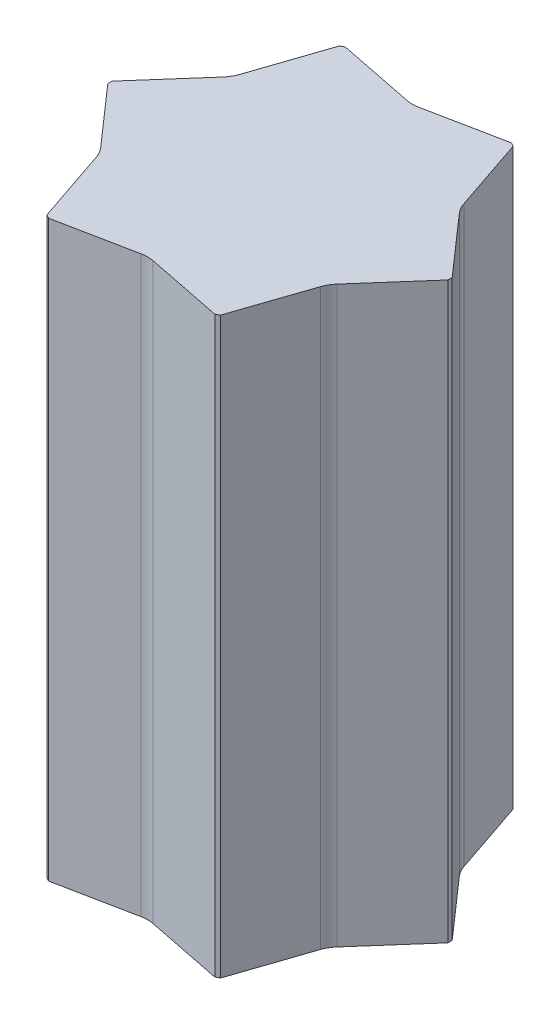
ISO-10303-21;
HEADER;
FILE_DESCRIPTION(('STEP AP214'),'2;1');
FILE_NAME('part.step','',(''),(''),'','','');
FILE_SCHEMA(('AUTOMOTIVE_DESIGN { 1 0 10303 214 1 1 1 1 }'));
ENDSEC;
DATA;
#1=APPLICATION_CONTEXT('core data for automotive mechanical design processes');
#2=APPLICATION_PROTOCOL_DEFINITION('international standard','automotive_design',2000,#1);
#3=PRODUCT_CONTEXT('',#1,'mechanical');
#4=PRODUCT('Part','Part','',(#3));
#5=PRODUCT_RELATED_PRODUCT_CATEGORY('part','',(#4));
#6=PRODUCT_DEFINITION_FORMATION('','',#4);
#7=PRODUCT_DEFINITION_CONTEXT('part definition',#1,'design');
#8=PRODUCT_DEFINITION('design','',#6,#7);
#9=PRODUCT_DEFINITION_SHAPE('','',#8);
#10=(LENGTH_UNIT() NAMED_UNIT(*) SI_UNIT(.MILLI.,.METRE.));
#11=(NAMED_UNIT(*) PLANE_ANGLE_UNIT() SI_UNIT($,.RADIAN.));
#12=(NAMED_UNIT(*) SI_UNIT($,.STERADIAN.) SOLID_ANGLE_UNIT());
#13=UNCERTAINTY_MEASURE_WITH_UNIT(LENGTH_MEASURE(1.E-05),#10,'distance_accuracy_value','');
#14=(GEOMETRIC_REPRESENTATION_CONTEXT(3) GLOBAL_UNCERTAINTY_ASSIGNED_CONTEXT((#13)) GLOBAL_UNIT_ASSIGNED_CONTEXT((#10,
#11,#12)) REPRESENTATION_CONTEXT('',''));
#15=CARTESIAN_POINT('',(0.,0.,0.));
#16=DIRECTION('',(0.,0.,1.));
#17=DIRECTION('',(1.,0.,0.));
#18=AXIS2_PLACEMENT_3D('',#15,#16,#17);
#19=CARTESIAN_POINT('',(-320.10061175492,650.,-184.810174364453));
#20=DIRECTION('',(0.,-1.,0.));
#21=DIRECTION('',(0.,0.,-1.));
#22=AXIS2_PLACEMENT_3D('',#19,#20,#21);
#23=CYLINDRICAL_SURFACE('',#22,70.0000000000001);
#24=CARTESIAN_POINT('',(-320.10061175492,-650.,-184.810174364453));
#25=DIRECTION('',(0.,-1.,0.));
#26=DIRECTION('',(0.,0.,1.));
#27=AXIS2_PLACEMENT_3D('',#24,#25,#26);
#28=CIRCLE('',#27,70.0000000000001);
#29=CARTESIAN_POINT('',(-253.79465983219,-650.,-162.37090655954));
#30=VERTEX_POINT('',#29);
#31=CARTESIAN_POINT('',(-267.514659832174,-650.,-138.607169479721));
#32=VERTEX_POINT('',#31);
#33=EDGE_CURVE('E236',#30,#32,#28,.T.);
#34=ORIENTED_EDGE('',*,*,#33,.T.);
#35=DIRECTION('',(0.,-1.,0.));
#36=VECTOR('',#35,1.);
#37=CARTESIAN_POINT('',(-267.514659832174,650.,-138.607169479721));
#38=LINE('',#37,#36);
#39=CARTESIAN_POINT('',(-267.514659832174,650.,-138.607169479721));
#40=VERTEX_POINT('',#39);
#41=EDGE_CURVE('E11',#40,#32,#38,.T.);
#42=ORIENTED_EDGE('',*,*,#41,.F.);
#43=CARTESIAN_POINT('',(-320.10061175492,650.,-184.810174364453));
#44=DIRECTION('',(0.,-1.,0.));
#45=DIRECTION('',(0.,0.,1.));
#46=AXIS2_PLACEMENT_3D('',#43,#44,#45);
#47=CIRCLE('',#46,70.0000000000001);
#48=CARTESIAN_POINT('',(-253.79465983219,650.,-162.37090655954));
#49=VERTEX_POINT('',#48);
#50=EDGE_CURVE('E306',#49,#40,#47,.T.);
#51=ORIENTED_EDGE('',*,*,#50,.F.);
#52=DIRECTION('',(0.,-1.,0.));
#53=VECTOR('',#52,1.);
#54=CARTESIAN_POINT('',(-253.79465983219,650.,-162.37090655954));
#55=LINE('',#54,#53);
#56=EDGE_CURVE('E232',#49,#30,#55,.T.);
#57=ORIENTED_EDGE('',*,*,#56,.T.);
#58=EDGE_LOOP('',(#34,#42,#51,#57));
#59=FACE_BOUND('',#58,.T.);
#60=ADVANCED_FACE('F39',(#59),#23,.F.);
#61=CARTESIAN_POINT('',(-267.514659832174,650.,-138.607169479721));
#62=DIRECTION('',(0.751227884610478,0.,0.660042926924959));
#63=DIRECTION('',(0.660042926924959,0.,-0.751227884610478));
#64=AXIS2_PLACEMENT_3D('',#61,#62,#63);
#65=PLANE('',#64);
#66=DIRECTION('',(-0.660042926924959,0.,0.751227884610478));
#67=VECTOR('',#66,1.);
#68=CARTESIAN_POINT('',(-267.514659832174,-650.,-138.607169479721));
#69=LINE('',#68,#67);
#70=CARTESIAN_POINT('',(-385.,-650.,-4.89122470291587));
#71=VERTEX_POINT('',#70);
#72=EDGE_CURVE('E240',#32,#71,#69,.T.);
#73=ORIENTED_EDGE('',*,*,#72,.T.);
#74=DIRECTION('',(0.,-1.,0.));
#75=VECTOR('',#74,1.);
#76=CARTESIAN_POINT('',(-385.,650.,-4.89122470291587));
#77=LINE('',#76,#75);
#78=CARTESIAN_POINT('',(-385.,650.,-4.89122470291587));
#79=VERTEX_POINT('',#78);
#80=EDGE_CURVE('E48',#79,#71,#77,.T.);
#81=ORIENTED_EDGE('',*,*,#80,.F.);
#82=DIRECTION('',(-0.660042926924959,0.,0.751227884610478));
#83=VECTOR('',#82,1.);
#84=CARTESIAN_POINT('',(-267.514659832174,650.,-138.607169479721));
#85=LINE('',#84,#83);
#86=EDGE_CURVE('E147',#40,#79,#85,.T.);
#87=ORIENTED_EDGE('',*,*,#86,.F.);
#88=ORIENTED_EDGE('',*,*,#41,.T.);
#89=EDGE_LOOP('',(#73,#81,#87,#88));
#90=FACE_BOUND('',#89,.T.);
#91=ADVANCED_FACE('F484',(#90),#65,.F.);
#92=CARTESIAN_POINT('',(-385.,650.,-4.89122470291587));
#93=DIRECTION('',(1.,0.,0.));
#94=DIRECTION('',(0.,0.,-1.));
#95=AXIS2_PLACEMENT_3D('',#92,#93,#94);
#96=PLANE('',#95);
#97=DIRECTION('',(0.,0.,1.));
#98=VECTOR('',#97,1.);
#99=CARTESIAN_POINT('',(-385.,-650.,-4.89122470291587));
#100=LINE('',#99,#98);
#101=CARTESIAN_POINT('',(-385.,-650.,4.89122470291184));
#102=VERTEX_POINT('',#101);
#103=EDGE_CURVE('E243',#71,#102,#100,.T.);
#104=ORIENTED_EDGE('',*,*,#103,.T.);
#105=DIRECTION('',(0.,-1.,0.));
#106=VECTOR('',#105,1.);
#107=CARTESIAN_POINT('',(-385.,650.,4.89122470291184));
#108=LINE('',#107,#106);
#109=CARTESIAN_POINT('',(-385.,650.,4.89122470291184));
#110=VERTEX_POINT('',#109);
#111=EDGE_CURVE('E381',#110,#102,#108,.T.);
#112=ORIENTED_EDGE('',*,*,#111,.F.);
#113=DIRECTION('',(0.,0.,1.));
#114=VECTOR('',#113,1.);
#115=CARTESIAN_POINT('',(-385.,650.,-4.89122470291587));
#116=LINE('',#115,#114);
#117=EDGE_CURVE('E391',#79,#110,#116,.T.);
#118=ORIENTED_EDGE('',*,*,#117,.F.);
#119=ORIENTED_EDGE('',*,*,#80,.T.);
#120=EDGE_LOOP('',(#104,#112,#118,#119));
#121=FACE_BOUND('',#120,.T.);
#122=ADVANCED_FACE('F389',(#121),#96,.F.);
#123=CARTESIAN_POINT('',(-385.,650.,4.89122470291184));
#124=DIRECTION('',(0.75122788461051,0.,-0.660042926924922));
#125=DIRECTION('',(-0.660042926924922,0.,-0.75122788461051));
#126=AXIS2_PLACEMENT_3D('',#123,#124,#125);
#127=PLANE('',#126);
#128=DIRECTION('',(0.660042926924922,0.,0.75122788461051));
#129=VECTOR('',#128,1.);
#130=CARTESIAN_POINT('',(-385.,-650.,4.89122470291184));
#131=LINE('',#130,#129);
#132=CARTESIAN_POINT('',(-267.514659832164,-650.,138.607169479741));
#133=VERTEX_POINT('',#132);
#134=EDGE_CURVE('E246',#102,#133,#131,.T.);
#135=ORIENTED_EDGE('',*,*,#134,.T.);
#136=DIRECTION('',(0.,-1.,0.));
#137=VECTOR('',#136,1.);
#138=CARTESIAN_POINT('',(-267.514659832164,650.,138.607169479741));
#139=LINE('',#138,#137);
#140=CARTESIAN_POINT('',(-267.514659832164,650.,138.607169479741));
#141=VERTEX_POINT('',#140);
#142=EDGE_CURVE('E377',#141,#133,#139,.T.);
#143=ORIENTED_EDGE('',*,*,#142,.F.);
#144=DIRECTION('',(0.660042926924922,0.,0.75122788461051));
#145=VECTOR('',#144,1.);
#146=CARTESIAN_POINT('',(-385.,650.,4.89122470291184));
#147=LINE('',#146,#145);
#148=EDGE_CURVE('E410',#110,#141,#147,.T.);
#149=ORIENTED_EDGE('',*,*,#148,.F.);
#150=ORIENTED_EDGE('',*,*,#111,.T.);
#151=EDGE_LOOP('',(#135,#143,#149,#150));
#152=FACE_BOUND('',#151,.T.);
#153=ADVANCED_FACE('F400',(#152),#127,.F.);
#154=CARTESIAN_POINT('',(-320.100611754906,650.,184.810174364478));
#155=DIRECTION('',(0.,-1.,0.));
#156=DIRECTION('',(0.,0.,-1.));
#157=AXIS2_PLACEMENT_3D('',#154,#155,#156);
#158=CYLINDRICAL_SURFACE('',#157,70.0000000000001);
#159=CARTESIAN_POINT('',(-320.100611754906,-650.,184.810174364478));
#160=DIRECTION('',(0.,-1.,0.));
#161=DIRECTION('',(0.,0.,1.));
#162=AXIS2_PLACEMENT_3D('',#159,#160,#161);
#163=CIRCLE('',#162,70.0000000000001);
#164=CARTESIAN_POINT('',(-253.79465983218,-650.,162.370906559555));
#165=VERTEX_POINT('',#164);
#166=EDGE_CURVE('E249',#133,#165,#163,.T.);
#167=ORIENTED_EDGE('',*,*,#166,.T.);
#168=DIRECTION('',(0.,-1.,0.));
#169=VECTOR('',#168,1.);
#170=CARTESIAN_POINT('',(-253.79465983218,650.,162.370906559555));
#171=LINE('',#170,#169);
#172=CARTESIAN_POINT('',(-253.79465983218,650.,162.370906559555));
#173=VERTEX_POINT('',#172);
#174=EDGE_CURVE('E373',#173,#165,#171,.T.);
#175=ORIENTED_EDGE('',*,*,#174,.F.);
#176=CARTESIAN_POINT('',(-320.100611754906,650.,184.810174364478));
#177=DIRECTION('',(0.,-1.,0.));
#178=DIRECTION('',(0.,0.,1.));
#179=AXIS2_PLACEMENT_3D('',#176,#177,#178);
#180=CIRCLE('',#179,70.0000000000001);
#181=EDGE_CURVE('E406',#141,#173,#180,.T.);
#182=ORIENTED_EDGE('',*,*,#181,.F.);
#183=ORIENTED_EDGE('',*,*,#142,.T.);
#184=EDGE_LOOP('',(#167,#175,#182,#183));
#185=FACE_BOUND('',#184,.T.);
#186=ADVANCED_FACE('F404',(#185),#158,.F.);
#187=CARTESIAN_POINT('',(-253.79465983218,650.,162.370906559555));
#188=DIRECTION('',(0.947227884610489,0.,-0.320560968641441));
#189=DIRECTION('',(-0.320560968641441,0.,-0.947227884610489));
#190=AXIS2_PLACEMENT_3D('',#187,#188,#189);
#191=PLANE('',#190);
#192=DIRECTION('',(0.320560968641441,0.,0.947227884610489));
#193=VECTOR('',#192,1.);
#194=CARTESIAN_POINT('',(-253.79465983218,-650.,162.370906559555));
#195=LINE('',#194,#193);
#196=CARTESIAN_POINT('',(-196.735924848342,-650.,330.974168105551));
#197=VERTEX_POINT('',#196);
#198=EDGE_CURVE('E252',#165,#197,#195,.T.);
#199=ORIENTED_EDGE('',*,*,#198,.T.);
#200=DIRECTION('',(0.,-1.,0.));
#201=VECTOR('',#200,1.);
#202=CARTESIAN_POINT('',(-196.735924848342,650.,330.974168105551));
#203=LINE('',#202,#201);
#204=CARTESIAN_POINT('',(-196.735924848342,650.,330.974168105551));
#205=VERTEX_POINT('',#204);
#206=EDGE_CURVE('E369',#205,#197,#203,.T.);
#207=ORIENTED_EDGE('',*,*,#206,.F.);
#208=DIRECTION('',(0.320560968641441,0.,0.947227884610489));
#209=VECTOR('',#208,1.);
#210=CARTESIAN_POINT('',(-253.79465983218,650.,162.370906559555));
#211=LINE('',#210,#209);
#212=EDGE_CURVE('E409',#173,#205,#211,.T.);
#213=ORIENTED_EDGE('',*,*,#212,.F.);
#214=ORIENTED_EDGE('',*,*,#174,.T.);
#215=EDGE_LOOP('',(#199,#207,#213,#214));
#216=FACE_BOUND('',#215,.T.);
#217=ADVANCED_FACE('F497',(#216),#191,.F.);
#218=CARTESIAN_POINT('',(-196.735924848342,650.,330.974168105551));
#219=DIRECTION('',(0.500000000000003,0.,-0.866025403784437));
#220=DIRECTION('',(-0.866025403784437,0.,-0.500000000000003));
#221=AXIS2_PLACEMENT_3D('',#218,#219,#220);
#222=PLANE('',#221);
#223=DIRECTION('',(0.866025403784437,0.,0.500000000000003));
#224=VECTOR('',#223,1.);
#225=CARTESIAN_POINT('',(-196.735924848342,-650.,330.974168105551));
#226=LINE('',#225,#224);
#227=CARTESIAN_POINT('',(-188.26407515166,-650.,335.865392808465));
#228=VERTEX_POINT('',#227);
#229=EDGE_CURVE('E255',#197,#228,#226,.T.);
#230=ORIENTED_EDGE('',*,*,#229,.T.);
#231=DIRECTION('',(0.,-1.,0.));
#232=VECTOR('',#231,1.);
#233=CARTESIAN_POINT('',(-188.26407515166,650.,335.865392808465));
#234=LINE('',#233,#232);
#235=CARTESIAN_POINT('',(-188.26407515166,650.,335.865392808465));
#236=VERTEX_POINT('',#235);
#237=EDGE_CURVE('E365',#236,#228,#234,.T.);
#238=ORIENTED_EDGE('',*,*,#237,.F.);
#239=DIRECTION('',(0.866025403784437,0.,0.500000000000003));
#240=VECTOR('',#239,1.);
#241=CARTESIAN_POINT('',(-196.735924848342,650.,330.974168105551));
#242=LINE('',#241,#240);
#243=EDGE_CURVE('E414',#205,#236,#242,.T.);
#244=ORIENTED_EDGE('',*,*,#243,.F.);
#245=ORIENTED_EDGE('',*,*,#206,.T.);
#246=EDGE_LOOP('',(#230,#238,#244,#245));
#247=FACE_BOUND('',#246,.T.);
#248=ADVANCED_FACE('F500',(#247),#222,.F.);
#249=CARTESIAN_POINT('',(-188.26407515166,650.,335.865392808465));
#250=DIRECTION('',(-0.195999999999941,0.,-0.980603895566412));
#251=DIRECTION('',(-0.980603895566412,0.,0.195999999999941));
#252=AXIS2_PLACEMENT_3D('',#249,#250,#251);
#253=PLANE('',#252);
#254=DIRECTION('',(0.980603895566412,0.,-0.195999999999941));
#255=VECTOR('',#254,1.);
#256=CARTESIAN_POINT('',(-188.26407515166,-650.,335.865392808465));
#257=LINE('',#256,#255);
#258=CARTESIAN_POINT('',(-13.7199999999692,-650.,300.978076039281));
#259=VERTEX_POINT('',#258);
#260=EDGE_CURVE('E258',#228,#259,#257,.T.);
#261=ORIENTED_EDGE('',*,*,#260,.T.);
#262=DIRECTION('',(0.,-1.,0.));
#263=VECTOR('',#262,1.);
#264=CARTESIAN_POINT('',(-13.7199999999692,650.,300.978076039281));
#265=LINE('',#264,#263);
#266=CARTESIAN_POINT('',(-13.7199999999692,650.,300.978076039281));
#267=VERTEX_POINT('',#266);
#268=EDGE_CURVE('E361',#267,#259,#265,.T.);
#269=ORIENTED_EDGE('',*,*,#268,.F.);
#270=DIRECTION('',(0.980603895566412,0.,-0.195999999999941));
#271=VECTOR('',#270,1.);
#272=CARTESIAN_POINT('',(-188.26407515166,650.,335.865392808465));
#273=LINE('',#272,#271);
#274=EDGE_CURVE('E421',#236,#267,#273,.T.);
#275=ORIENTED_EDGE('',*,*,#274,.F.);
#276=ORIENTED_EDGE('',*,*,#237,.T.);
#277=EDGE_LOOP('',(#261,#269,#275,#276));
#278=FACE_BOUND('',#277,.T.);
#279=ADVANCED_FACE('F504',(#278),#253,.F.);
#280=CARTESIAN_POINT('',(1.82956728387476E-11,650.,369.620348728931));
#281=DIRECTION('',(0.,-1.,0.));
#282=DIRECTION('',(0.,0.,-1.));
#283=AXIS2_PLACEMENT_3D('',#280,#281,#282);
#284=CYLINDRICAL_SURFACE('',#283,70.0000000000005);
#285=CARTESIAN_POINT('',(1.82956728387476E-11,-650.,369.620348728931));
#286=DIRECTION('',(0.,-1.,0.));
#287=DIRECTION('',(0.,0.,1.));
#288=AXIS2_PLACEMENT_3D('',#285,#286,#287);
#289=CIRCLE('',#288,70.0000000000005);
#290=CARTESIAN_POINT('',(13.7199999999938,-650.,300.978076039278));
#291=VERTEX_POINT('',#290);
#292=EDGE_CURVE('E261',#259,#291,#289,.T.);
#293=ORIENTED_EDGE('',*,*,#292,.T.);
#294=DIRECTION('',(0.,-1.,0.));
#295=VECTOR('',#294,1.);
#296=CARTESIAN_POINT('',(13.7199999999938,650.,300.978076039278));
#297=LINE('',#296,#295);
#298=CARTESIAN_POINT('',(13.7199999999938,650.,300.978076039278));
#299=VERTEX_POINT('',#298);
#300=EDGE_CURVE('E357',#299,#291,#297,.T.);
#301=ORIENTED_EDGE('',*,*,#300,.F.);
#302=CARTESIAN_POINT('',(1.82956728387476E-11,650.,369.620348728931));
#303=DIRECTION('',(0.,-1.,0.));
#304=DIRECTION('',(0.,0.,1.));
#305=AXIS2_PLACEMENT_3D('',#302,#303,#304);
#306=CIRCLE('',#305,70.0000000000005);
#307=EDGE_CURVE('E424',#267,#299,#306,.T.);
#308=ORIENTED_EDGE('',*,*,#307,.F.);
#309=ORIENTED_EDGE('',*,*,#268,.T.);
#310=EDGE_LOOP('',(#293,#301,#308,#309));
#311=FACE_BOUND('',#310,.T.);
#312=ADVANCED_FACE('F508',(#311),#284,.F.);
#313=CARTESIAN_POINT('',(13.7199999999939,650.,300.978076039278));
#314=DIRECTION('',(0.195999999999994,0.,-0.980603895566401));
#315=DIRECTION('',(-0.980603895566402,0.,-0.195999999999994));
#316=AXIS2_PLACEMENT_3D('',#313,#314,#315);
#317=PLANE('',#316);
#318=DIRECTION('',(0.980603895566402,0.,0.195999999999994));
#319=VECTOR('',#318,1.);
#320=CARTESIAN_POINT('',(13.7199999999939,-650.,300.978076039278));
#321=LINE('',#320,#319);
#322=CARTESIAN_POINT('',(188.264075151658,-650.,335.865392808466));
#323=VERTEX_POINT('',#322);
#324=EDGE_CURVE('E264',#291,#323,#321,.T.);
#325=ORIENTED_EDGE('',*,*,#324,.T.);
#326=DIRECTION('',(0.,-1.,0.));
#327=VECTOR('',#326,1.);
#328=CARTESIAN_POINT('',(188.264075151658,650.,335.865392808466));
#329=LINE('',#328,#327);
#330=CARTESIAN_POINT('',(188.264075151658,650.,335.865392808466));
#331=VERTEX_POINT('',#330);
#332=EDGE_CURVE('E353',#331,#323,#329,.T.);
#333=ORIENTED_EDGE('',*,*,#332,.F.);
#334=DIRECTION('',(0.980603895566402,0.,0.195999999999994));
#335=VECTOR('',#334,1.);
#336=CARTESIAN_POINT('',(13.7199999999939,650.,300.978076039278));
#337=LINE('',#336,#335);
#338=EDGE_CURVE('E427',#299,#331,#337,.T.);
#339=ORIENTED_EDGE('',*,*,#338,.F.);
#340=ORIENTED_EDGE('',*,*,#300,.T.);
#341=EDGE_LOOP('',(#325,#333,#339,#340));
#342=FACE_BOUND('',#341,.T.);
#343=ADVANCED_FACE('F512',(#342),#317,.F.);
#344=CARTESIAN_POINT('',(188.264075151658,650.,335.865392808466));
#345=DIRECTION('',(-0.500000000000012,0.,-0.866025403784432));
#346=DIRECTION('',(-0.866025403784432,0.,0.500000000000012));
#347=AXIS2_PLACEMENT_3D('',#344,#345,#346);
#348=PLANE('',#347);
#349=DIRECTION('',(0.866025403784432,0.,-0.500000000000012));
#350=VECTOR('',#349,1.);
#351=CARTESIAN_POINT('',(188.264075151658,-650.,335.865392808466));
#352=LINE('',#351,#350);
#353=CARTESIAN_POINT('',(196.73592484834,-650.,330.974168105553));
#354=VERTEX_POINT('',#353);
#355=EDGE_CURVE('E267',#323,#354,#352,.T.);
#356=ORIENTED_EDGE('',*,*,#355,.T.);
#357=DIRECTION('',(0.,-1.,0.));
#358=VECTOR('',#357,1.);
#359=CARTESIAN_POINT('',(196.73592484834,650.,330.974168105553));
#360=LINE('',#359,#358);
#361=CARTESIAN_POINT('',(196.73592484834,650.,330.974168105553));
#362=VERTEX_POINT('',#361);
#363=EDGE_CURVE('E349',#362,#354,#360,.T.);
#364=ORIENTED_EDGE('',*,*,#363,.F.);
#365=DIRECTION('',(0.866025403784432,0.,-0.500000000000012));
#366=VECTOR('',#365,1.);
#367=CARTESIAN_POINT('',(188.264075151658,650.,335.865392808466));
#368=LINE('',#367,#366);
#369=EDGE_CURVE('E430',#331,#362,#368,.T.);
#370=ORIENTED_EDGE('',*,*,#369,.F.);
#371=ORIENTED_EDGE('',*,*,#332,.T.);
#372=EDGE_LOOP('',(#356,#364,#370,#371));
#373=FACE_BOUND('',#372,.T.);
#374=ADVANCED_FACE('F516',(#373),#348,.F.);
#375=CARTESIAN_POINT('',(196.73592484834,650.,330.974168105553));
#376=DIRECTION('',(-0.94722788461046,0.,-0.320560968641524));
#377=DIRECTION('',(-0.320560968641524,0.,0.947227884610461));
#378=AXIS2_PLACEMENT_3D('',#375,#376,#377);
#379=PLANE('',#378);
#380=DIRECTION('',(0.320560968641524,0.,-0.94722788461046));
#381=VECTOR('',#380,1.);
#382=CARTESIAN_POINT('',(196.73592484834,-650.,330.974168105553));
#383=LINE('',#382,#381);
#384=CARTESIAN_POINT('',(253.794659832199,-650.,162.37090655954));
#385=VERTEX_POINT('',#384);
#386=EDGE_CURVE('E270',#354,#385,#383,.T.);
#387=ORIENTED_EDGE('',*,*,#386,.T.);
#388=DIRECTION('',(0.,-1.,0.));
#389=VECTOR('',#388,1.);
#390=CARTESIAN_POINT('',(253.794659832199,650.,162.37090655954));
#391=LINE('',#390,#389);
#392=CARTESIAN_POINT('',(253.794659832199,650.,162.37090655954));
#393=VERTEX_POINT('',#392);
#394=EDGE_CURVE('E345',#393,#385,#391,.T.);
#395=ORIENTED_EDGE('',*,*,#394,.F.);
#396=DIRECTION('',(0.320560968641524,0.,-0.94722788461046));
#397=VECTOR('',#396,1.);
#398=CARTESIAN_POINT('',(196.73592484834,650.,330.974168105553));
#399=LINE('',#398,#397);
#400=EDGE_CURVE('E433',#362,#393,#399,.T.);
#401=ORIENTED_EDGE('',*,*,#400,.F.);
#402=ORIENTED_EDGE('',*,*,#363,.T.);
#403=EDGE_LOOP('',(#387,#395,#401,#402));
#404=FACE_BOUND('',#403,.T.);
#405=ADVANCED_FACE('F520',(#404),#379,.F.);
#406=CARTESIAN_POINT('',(320.100611754929,650.,184.810174364454));
#407=DIRECTION('',(0.,-1.,0.));
#408=DIRECTION('',(0.,0.,-1.));
#409=AXIS2_PLACEMENT_3D('',#406,#407,#408);
#410=CYLINDRICAL_SURFACE('',#409,70.000000000001);
#411=CARTESIAN_POINT('',(320.100611754929,-650.,184.810174364454));
#412=DIRECTION('',(0.,-1.,0.));
#413=DIRECTION('',(0.,0.,1.));
#414=AXIS2_PLACEMENT_3D('',#411,#412,#413);
#415=CIRCLE('',#414,70.000000000001);
#416=CARTESIAN_POINT('',(267.51465983218,-650.,138.607169479723));
#417=VERTEX_POINT('',#416);
#418=EDGE_CURVE('E273',#385,#417,#415,.T.);
#419=ORIENTED_EDGE('',*,*,#418,.T.);
#420=DIRECTION('',(0.,-1.,0.));
#421=VECTOR('',#420,1.);
#422=CARTESIAN_POINT('',(267.51465983218,650.,138.607169479723));
#423=LINE('',#422,#421);
#424=CARTESIAN_POINT('',(267.51465983218,650.,138.607169479723));
#425=VERTEX_POINT('',#424);
#426=EDGE_CURVE('E341',#425,#417,#423,.T.);
#427=ORIENTED_EDGE('',*,*,#426,.F.);
#428=CARTESIAN_POINT('',(320.100611754929,650.,184.810174364454));
#429=DIRECTION('',(0.,-1.,0.));
#430=DIRECTION('',(0.,0.,1.));
#431=AXIS2_PLACEMENT_3D('',#428,#429,#430);
#432=CIRCLE('',#431,70.000000000001);
#433=EDGE_CURVE('E436',#393,#425,#432,.T.);
#434=ORIENTED_EDGE('',*,*,#433,.F.);
#435=ORIENTED_EDGE('',*,*,#394,.T.);
#436=EDGE_LOOP('',(#419,#427,#434,#435));
#437=FACE_BOUND('',#436,.T.);
#438=ADVANCED_FACE('F524',(#437),#410,.F.);
#439=CARTESIAN_POINT('',(267.514659832179,650.,138.607169479723));
#440=DIRECTION('',(-0.751227884610503,0.,-0.66004292692493));
#441=DIRECTION('',(-0.66004292692493,0.,0.751227884610503));
#442=AXIS2_PLACEMENT_3D('',#439,#440,#441);
#443=PLANE('',#442);
#444=DIRECTION('',(0.66004292692493,0.,-0.751227884610503));
#445=VECTOR('',#444,1.);
#446=CARTESIAN_POINT('',(267.514659832179,-650.,138.607169479723));
#447=LINE('',#446,#445);
#448=CARTESIAN_POINT('',(385.,-650.,4.89122470291325));
#449=VERTEX_POINT('',#448);
#450=EDGE_CURVE('E276',#417,#449,#447,.T.);
#451=ORIENTED_EDGE('',*,*,#450,.T.);
#452=DIRECTION('',(0.,-1.,0.));
#453=VECTOR('',#452,1.);
#454=CARTESIAN_POINT('',(385.,650.,4.89122470291325));
#455=LINE('',#454,#453);
#456=CARTESIAN_POINT('',(385.,650.,4.89122470291325));
#457=VERTEX_POINT('',#456);
#458=EDGE_CURVE('E337',#457,#449,#455,.T.);
#459=ORIENTED_EDGE('',*,*,#458,.F.);
#460=DIRECTION('',(0.66004292692493,0.,-0.751227884610503));
#461=VECTOR('',#460,1.);
#462=CARTESIAN_POINT('',(267.514659832179,650.,138.607169479723));
#463=LINE('',#462,#461);
#464=EDGE_CURVE('E439',#425,#457,#463,.T.);
#465=ORIENTED_EDGE('',*,*,#464,.F.);
#466=ORIENTED_EDGE('',*,*,#426,.T.);
#467=EDGE_LOOP('',(#451,#459,#465,#466));
#468=FACE_BOUND('',#467,.T.);
#469=ADVANCED_FACE('F528',(#468),#443,.F.);
#470=CARTESIAN_POINT('',(385.,650.,4.89122470291325));
#471=DIRECTION('',(-1.,0.,0.));
#472=DIRECTION('',(0.,0.,1.));
#473=AXIS2_PLACEMENT_3D('',#470,#471,#472);
#474=PLANE('',#473);
#475=DIRECTION('',(0.,0.,-1.));
#476=VECTOR('',#475,1.);
#477=CARTESIAN_POINT('',(385.,-650.,4.89122470291325));
#478=LINE('',#477,#476);
#479=CARTESIAN_POINT('',(385.,-650.,-4.89122470291196));
#480=VERTEX_POINT('',#479);
#481=EDGE_CURVE('E279',#449,#480,#478,.T.);
#482=ORIENTED_EDGE('',*,*,#481,.T.);
#483=DIRECTION('',(0.,-1.,0.));
#484=VECTOR('',#483,1.);
#485=CARTESIAN_POINT('',(385.,650.,-4.89122470291196));
#486=LINE('',#485,#484);
#487=CARTESIAN_POINT('',(385.,650.,-4.89122470291196));
#488=VERTEX_POINT('',#487);
#489=EDGE_CURVE('E333',#488,#480,#486,.T.);
#490=ORIENTED_EDGE('',*,*,#489,.F.);
#491=DIRECTION('',(0.,0.,-1.));
#492=VECTOR('',#491,1.);
#493=CARTESIAN_POINT('',(385.,650.,4.89122470291325));
#494=LINE('',#493,#492);
#495=EDGE_CURVE('E442',#457,#488,#494,.T.);
#496=ORIENTED_EDGE('',*,*,#495,.F.);
#497=ORIENTED_EDGE('',*,*,#458,.T.);
#498=EDGE_LOOP('',(#482,#490,#496,#497));
#499=FACE_BOUND('',#498,.T.);
#500=ADVANCED_FACE('F532',(#499),#474,.F.);
#501=CARTESIAN_POINT('',(385.,650.,-4.89122470291196));
#502=DIRECTION('',(-0.751227884610533,0.,0.660042926924897));
#503=DIRECTION('',(0.660042926924897,0.,0.751227884610533));
#504=AXIS2_PLACEMENT_3D('',#501,#502,#503);
#505=PLANE('',#504);
#506=DIRECTION('',(-0.660042926924897,0.,-0.751227884610533));
#507=VECTOR('',#506,1.);
#508=CARTESIAN_POINT('',(385.,-650.,-4.89122470291196));
#509=LINE('',#508,#507);
#510=CARTESIAN_POINT('',(267.514659832173,-650.,-138.607169479741));
#511=VERTEX_POINT('',#510);
#512=EDGE_CURVE('E282',#480,#511,#509,.T.);
#513=ORIENTED_EDGE('',*,*,#512,.T.);
#514=DIRECTION('',(0.,-1.,0.));
#515=VECTOR('',#514,1.);
#516=CARTESIAN_POINT('',(267.514659832173,650.,-138.607169479741));
#517=LINE('',#516,#515);
#518=CARTESIAN_POINT('',(267.514659832173,650.,-138.607169479741));
#519=VERTEX_POINT('',#518);
#520=EDGE_CURVE('E329',#519,#511,#517,.T.);
#521=ORIENTED_EDGE('',*,*,#520,.F.);
#522=DIRECTION('',(-0.660042926924897,0.,-0.751227884610533));
#523=VECTOR('',#522,1.);
#524=CARTESIAN_POINT('',(385.,650.,-4.89122470291196));
#525=LINE('',#524,#523);
#526=EDGE_CURVE('E445',#488,#519,#525,.T.);
#527=ORIENTED_EDGE('',*,*,#526,.F.);
#528=ORIENTED_EDGE('',*,*,#489,.T.);
#529=EDGE_LOOP('',(#513,#521,#527,#528));
#530=FACE_BOUND('',#529,.T.);
#531=ADVANCED_FACE('F536',(#530),#505,.F.);
#532=CARTESIAN_POINT('',(320.100611754915,650.,-184.810174364478));
#533=DIRECTION('',(0.,-1.,0.));
#534=DIRECTION('',(0.,0.,-1.));
#535=AXIS2_PLACEMENT_3D('',#532,#533,#534);
#536=CYLINDRICAL_SURFACE('',#535,70.0000000000011);
#537=CARTESIAN_POINT('',(320.100611754915,-650.,-184.810174364478));
#538=DIRECTION('',(0.,-1.,0.));
#539=DIRECTION('',(0.,0.,1.));
#540=AXIS2_PLACEMENT_3D('',#537,#538,#539);
#541=CIRCLE('',#540,70.0000000000011);
#542=CARTESIAN_POINT('',(253.794659832185,-650.,-162.37090655956));
#543=VERTEX_POINT('',#542);
#544=EDGE_CURVE('E285',#511,#543,#541,.T.);
#545=ORIENTED_EDGE('',*,*,#544,.T.);
#546=DIRECTION('',(0.,-1.,0.));
#547=VECTOR('',#546,1.);
#548=CARTESIAN_POINT('',(253.794659832185,650.,-162.37090655956));
#549=LINE('',#548,#547);
#550=CARTESIAN_POINT('',(253.794659832185,650.,-162.37090655956));
#551=VERTEX_POINT('',#550);
#552=EDGE_CURVE('E325',#551,#543,#549,.T.);
#553=ORIENTED_EDGE('',*,*,#552,.F.);
#554=CARTESIAN_POINT('',(320.100611754915,650.,-184.810174364478));
#555=DIRECTION('',(0.,-1.,0.));
#556=DIRECTION('',(0.,0.,1.));
#557=AXIS2_PLACEMENT_3D('',#554,#555,#556);
#558=CIRCLE('',#557,70.0000000000011);
#559=EDGE_CURVE('E448',#519,#551,#558,.T.);
#560=ORIENTED_EDGE('',*,*,#559,.F.);
#561=ORIENTED_EDGE('',*,*,#520,.T.);
#562=EDGE_LOOP('',(#545,#553,#560,#561));
#563=FACE_BOUND('',#562,.T.);
#564=ADVANCED_FACE('F540',(#563),#536,.F.);
#565=CARTESIAN_POINT('',(253.794659832184,650.,-162.37090655956));
#566=DIRECTION('',(-0.947227884610474,0.,0.320560968641484));
#567=DIRECTION('',(0.320560968641484,0.,0.947227884610474));
#568=AXIS2_PLACEMENT_3D('',#565,#566,#567);
#569=PLANE('',#568);
#570=DIRECTION('',(-0.320560968641484,0.,-0.947227884610474));
#571=VECTOR('',#570,1.);
#572=CARTESIAN_POINT('',(253.794659832184,-650.,-162.37090655956));
#573=LINE('',#572,#571);
#574=CARTESIAN_POINT('',(196.735924848339,-650.,-330.974168105553));
#575=VERTEX_POINT('',#574);
#576=EDGE_CURVE('E288',#543,#575,#573,.T.);
#577=ORIENTED_EDGE('',*,*,#576,.T.);
#578=DIRECTION('',(0.,-1.,0.));
#579=VECTOR('',#578,1.);
#580=CARTESIAN_POINT('',(196.735924848339,650.,-330.974168105553));
#581=LINE('',#580,#579);
#582=CARTESIAN_POINT('',(196.735924848339,650.,-330.974168105553));
#583=VERTEX_POINT('',#582);
#584=EDGE_CURVE('E321',#583,#575,#581,.T.);
#585=ORIENTED_EDGE('',*,*,#584,.F.);
#586=DIRECTION('',(-0.320560968641484,0.,-0.947227884610474));
#587=VECTOR('',#586,1.);
#588=CARTESIAN_POINT('',(253.794659832184,650.,-162.37090655956));
#589=LINE('',#588,#587);
#590=EDGE_CURVE('E451',#551,#583,#589,.T.);
#591=ORIENTED_EDGE('',*,*,#590,.F.);
#592=ORIENTED_EDGE('',*,*,#552,.T.);
#593=EDGE_LOOP('',(#577,#585,#591,#592));
#594=FACE_BOUND('',#593,.T.);
#595=ADVANCED_FACE('F544',(#594),#569,.F.);
#596=CARTESIAN_POINT('',(196.735924848339,650.,-330.974168105553));
#597=DIRECTION('',(-0.5,0.,0.866025403784438));
#598=DIRECTION('',(0.866025403784439,0.,0.5));
#599=AXIS2_PLACEMENT_3D('',#596,#597,#598);
#600=PLANE('',#599);
#601=DIRECTION('',(-0.866025403784439,0.,-0.5));
#602=VECTOR('',#601,1.);
#603=CARTESIAN_POINT('',(196.735924848339,-650.,-330.974168105553));
#604=LINE('',#603,#602);
#605=CARTESIAN_POINT('',(188.264075151661,-650.,-335.865392808465));
#606=VERTEX_POINT('',#605);
#607=EDGE_CURVE('E291',#575,#606,#604,.T.);
#608=ORIENTED_EDGE('',*,*,#607,.T.);
#609=DIRECTION('',(0.,-1.,0.));
#610=VECTOR('',#609,1.);
#611=CARTESIAN_POINT('',(188.264075151661,650.,-335.865392808465));
#612=LINE('',#611,#610);
#613=CARTESIAN_POINT('',(188.264075151661,650.,-335.865392808465));
#614=VERTEX_POINT('',#613);
#615=EDGE_CURVE('E317',#614,#606,#612,.T.);
#616=ORIENTED_EDGE('',*,*,#615,.F.);
#617=DIRECTION('',(-0.866025403784439,0.,-0.5));
#618=VECTOR('',#617,1.);
#619=CARTESIAN_POINT('',(196.735924848339,650.,-330.974168105553));
#620=LINE('',#619,#618);
#621=EDGE_CURVE('E454',#583,#614,#620,.T.);
#622=ORIENTED_EDGE('',*,*,#621,.F.);
#623=ORIENTED_EDGE('',*,*,#584,.T.);
#624=EDGE_LOOP('',(#608,#616,#622,#623));
#625=FACE_BOUND('',#624,.T.);
#626=ADVANCED_FACE('F548',(#625),#600,.F.);
#627=CARTESIAN_POINT('',(188.264075151661,650.,-335.865392808465));
#628=DIRECTION('',(0.195999999999966,0.,0.980603895566407));
#629=DIRECTION('',(0.980603895566407,0.,-0.195999999999966));
#630=AXIS2_PLACEMENT_3D('',#627,#628,#629);
#631=PLANE('',#630);
#632=DIRECTION('',(-0.980603895566407,0.,0.195999999999966));
#633=VECTOR('',#632,1.);
#634=CARTESIAN_POINT('',(188.264075151661,-650.,-335.865392808465));
#635=LINE('',#634,#633);
#636=CARTESIAN_POINT('',(13.7199999999787,-650.,-300.978076039278));
#637=VERTEX_POINT('',#636);
#638=EDGE_CURVE('E294',#606,#637,#635,.T.);
#639=ORIENTED_EDGE('',*,*,#638,.T.);
#640=DIRECTION('',(0.,-1.,0.));
#641=VECTOR('',#640,1.);
#642=CARTESIAN_POINT('',(13.7199999999787,650.,-300.978076039278));
#643=LINE('',#642,#641);
#644=CARTESIAN_POINT('',(13.7199999999787,650.,-300.978076039278));
#645=VERTEX_POINT('',#644);
#646=EDGE_CURVE('E313',#645,#637,#643,.T.);
#647=ORIENTED_EDGE('',*,*,#646,.F.);
#648=DIRECTION('',(-0.980603895566407,0.,0.195999999999966));
#649=VECTOR('',#648,1.);
#650=CARTESIAN_POINT('',(188.264075151661,650.,-335.865392808465));
#651=LINE('',#650,#649);
#652=EDGE_CURVE('E457',#614,#645,#651,.T.);
#653=ORIENTED_EDGE('',*,*,#652,.F.);
#654=ORIENTED_EDGE('',*,*,#615,.T.);
#655=EDGE_LOOP('',(#639,#647,#653,#654));
#656=FACE_BOUND('',#655,.T.);
#657=ADVANCED_FACE('F465',(#656),#631,.F.);
#658=CARTESIAN_POINT('',(-9.54903444555092E-12,650.,-369.620348728931));
#659=DIRECTION('',(0.,-1.,0.));
#660=DIRECTION('',(0.,0.,-1.));
#661=AXIS2_PLACEMENT_3D('',#658,#659,#660);
#662=CYLINDRICAL_SURFACE('',#661,70.0000000000026);
#663=CARTESIAN_POINT('',(-9.54903444555092E-12,-650.,-369.620348728931));
#664=DIRECTION('',(0.,-1.,0.));
#665=DIRECTION('',(0.,0.,1.));
#666=AXIS2_PLACEMENT_3D('',#663,#664,#665);
#667=CIRCLE('',#666,70.0000000000026);
#668=CARTESIAN_POINT('',(-13.7199999999979,-650.,-300.978076039278));
#669=VERTEX_POINT('',#668);
#670=EDGE_CURVE('E297',#637,#669,#667,.T.);
#671=ORIENTED_EDGE('',*,*,#670,.T.);
#672=DIRECTION('',(0.,-1.,0.));
#673=VECTOR('',#672,1.);
#674=CARTESIAN_POINT('',(-13.7199999999979,650.,-300.978076039278));
#675=LINE('',#674,#673);
#676=CARTESIAN_POINT('',(-13.7199999999979,650.,-300.978076039278));
#677=VERTEX_POINT('',#676);
#678=EDGE_CURVE('E225',#677,#669,#675,.T.);
#679=ORIENTED_EDGE('',*,*,#678,.F.);
#680=CARTESIAN_POINT('',(-9.54903444555092E-12,650.,-369.620348728931));
#681=DIRECTION('',(0.,-1.,0.));
#682=DIRECTION('',(0.,0.,1.));
#683=AXIS2_PLACEMENT_3D('',#680,#681,#682);
#684=CIRCLE('',#683,70.0000000000026);
#685=EDGE_CURVE('E214',#645,#677,#684,.T.);
#686=ORIENTED_EDGE('',*,*,#685,.F.);
#687=ORIENTED_EDGE('',*,*,#646,.T.);
#688=EDGE_LOOP('',(#671,#679,#686,#687));
#689=FACE_BOUND('',#688,.T.);
#690=ADVANCED_FACE('F469',(#689),#662,.F.);
#691=CARTESIAN_POINT('',(-13.7199999999978,650.,-300.978076039278));
#692=DIRECTION('',(-0.195999999999986,0.,0.980603895566403));
#693=DIRECTION('',(0.980603895566403,0.,0.195999999999986));
#694=AXIS2_PLACEMENT_3D('',#691,#692,#693);
#695=PLANE('',#694);
#696=DIRECTION('',(-0.980603895566403,0.,-0.195999999999986));
#697=VECTOR('',#696,1.);
#698=CARTESIAN_POINT('',(-13.7199999999978,-650.,-300.978076039278));
#699=LINE('',#698,#697);
#700=CARTESIAN_POINT('',(-188.264075151661,-650.,-335.865392808465));
#701=VERTEX_POINT('',#700);
#702=EDGE_CURVE('E223',#669,#701,#699,.T.);
#703=ORIENTED_EDGE('',*,*,#702,.T.);
#704=DIRECTION('',(0.,-1.,0.));
#705=VECTOR('',#704,1.);
#706=CARTESIAN_POINT('',(-188.264075151661,650.,-335.865392808465));
#707=LINE('',#706,#705);
#708=CARTESIAN_POINT('',(-188.264075151661,650.,-335.865392808465));
#709=VERTEX_POINT('',#708);
#710=EDGE_CURVE('E220',#709,#701,#707,.T.);
#711=ORIENTED_EDGE('',*,*,#710,.F.);
#712=DIRECTION('',(-0.980603895566403,0.,-0.195999999999986));
#713=VECTOR('',#712,1.);
#714=CARTESIAN_POINT('',(-13.7199999999978,650.,-300.978076039278));
#715=LINE('',#714,#713);
#716=EDGE_CURVE('E208',#677,#709,#715,.T.);
#717=ORIENTED_EDGE('',*,*,#716,.F.);
#718=ORIENTED_EDGE('',*,*,#678,.T.);
#719=EDGE_LOOP('',(#703,#711,#717,#718));
#720=FACE_BOUND('',#719,.T.);
#721=ADVANCED_FACE('F221',(#720),#695,.F.);
#722=CARTESIAN_POINT('',(-188.264075151661,650.,-335.865392808465));
#723=DIRECTION('',(0.500000000000034,0.,0.866025403784419));
#724=DIRECTION('',(0.866025403784419,0.,-0.500000000000034));
#725=AXIS2_PLACEMENT_3D('',#722,#723,#724);
#726=PLANE('',#725);
#727=DIRECTION('',(-0.866025403784419,0.,0.500000000000034));
#728=VECTOR('',#727,1.);
#729=CARTESIAN_POINT('',(-188.264075151661,-650.,-335.865392808465));
#730=LINE('',#729,#728);
#731=CARTESIAN_POINT('',(-196.735924848344,-650.,-330.97416810555));
#732=VERTEX_POINT('',#731);
#733=EDGE_CURVE('E133',#701,#732,#730,.T.);
#734=ORIENTED_EDGE('',*,*,#733,.T.);
#735=DIRECTION('',(0.,-1.,0.));
#736=VECTOR('',#735,1.);
#737=CARTESIAN_POINT('',(-196.735924848344,650.,-330.97416810555));
#738=LINE('',#737,#736);
#739=CARTESIAN_POINT('',(-196.735924848344,650.,-330.97416810555));
#740=VERTEX_POINT('',#739);
#741=EDGE_CURVE('E226',#740,#732,#738,.T.);
#742=ORIENTED_EDGE('',*,*,#741,.F.);
#743=DIRECTION('',(-0.866025403784419,0.,0.500000000000034));
#744=VECTOR('',#743,1.);
#745=CARTESIAN_POINT('',(-188.264075151661,650.,-335.865392808465));
#746=LINE('',#745,#744);
#747=EDGE_CURVE('E212',#709,#740,#746,.T.);
#748=ORIENTED_EDGE('',*,*,#747,.F.);
#749=ORIENTED_EDGE('',*,*,#710,.T.);
#750=EDGE_LOOP('',(#734,#742,#748,#749));
#751=FACE_BOUND('',#750,.T.);
#752=ADVANCED_FACE('F228',(#751),#726,.F.);
#753=CARTESIAN_POINT('',(-196.735924848344,650.,-330.97416810555));
#754=DIRECTION('',(0.947227884610482,0.,0.320560968641461));
#755=DIRECTION('',(0.320560968641461,0.,-0.947227884610482));
#756=AXIS2_PLACEMENT_3D('',#753,#754,#755);
#757=PLANE('',#756);
#758=DIRECTION('',(-0.320560968641461,0.,0.947227884610482));
#759=VECTOR('',#758,1.);
#760=CARTESIAN_POINT('',(-196.735924848344,-650.,-330.97416810555));
#761=LINE('',#760,#759);
#762=EDGE_CURVE('E139',#732,#30,#761,.T.);
#763=ORIENTED_EDGE('',*,*,#762,.T.);
#764=ORIENTED_EDGE('',*,*,#56,.F.);
#765=DIRECTION('',(-0.320560968641461,0.,0.947227884610482));
#766=VECTOR('',#765,1.);
#767=CARTESIAN_POINT('',(-196.735924848344,650.,-330.97416810555));
#768=LINE('',#767,#766);
#769=EDGE_CURVE('E56',#740,#49,#768,.T.);
#770=ORIENTED_EDGE('',*,*,#769,.F.);
#771=ORIENTED_EDGE('',*,*,#741,.T.);
#772=EDGE_LOOP('',(#763,#764,#770,#771));
#773=FACE_BOUND('',#772,.T.);
#774=ADVANCED_FACE('F473',(#773),#757,.F.);
#775=CARTESIAN_POINT('',(-320.10061175492,650.,-184.810174364453));
#776=DIRECTION('',(0.,1.,0.));
#777=DIRECTION('',(0.,0.,1.));
#778=AXIS2_PLACEMENT_3D('',#775,#776,#777);
#779=PLANE('',#778);
#780=ORIENTED_EDGE('',*,*,#50,.T.);
#781=ORIENTED_EDGE('',*,*,#86,.T.);
#782=ORIENTED_EDGE('',*,*,#117,.T.);
#783=ORIENTED_EDGE('',*,*,#148,.T.);
#784=ORIENTED_EDGE('',*,*,#181,.T.);
#785=ORIENTED_EDGE('',*,*,#212,.T.);
#786=ORIENTED_EDGE('',*,*,#243,.T.);
#787=ORIENTED_EDGE('',*,*,#274,.T.);
#788=ORIENTED_EDGE('',*,*,#307,.T.);
#789=ORIENTED_EDGE('',*,*,#338,.T.);
#790=ORIENTED_EDGE('',*,*,#369,.T.);
#791=ORIENTED_EDGE('',*,*,#400,.T.);
#792=ORIENTED_EDGE('',*,*,#433,.T.);
#793=ORIENTED_EDGE('',*,*,#464,.T.);
#794=ORIENTED_EDGE('',*,*,#495,.T.);
#795=ORIENTED_EDGE('',*,*,#526,.T.);
#796=ORIENTED_EDGE('',*,*,#559,.T.);
#797=ORIENTED_EDGE('',*,*,#590,.T.);
#798=ORIENTED_EDGE('',*,*,#621,.T.);
#799=ORIENTED_EDGE('',*,*,#652,.T.);
#800=ORIENTED_EDGE('',*,*,#685,.T.);
#801=ORIENTED_EDGE('',*,*,#716,.T.);
#802=ORIENTED_EDGE('',*,*,#747,.T.);
#803=ORIENTED_EDGE('',*,*,#769,.T.);
#804=EDGE_LOOP('',(#780,#781,#782,#783,#784,#785,#786,#787,#788,#789,#790,#791,#792,#793,#794,
#795,#796,#797,#798,#799,#800,#801,#802,#803));
#805=FACE_BOUND('',#804,.T.);
#806=ADVANCED_FACE('F210',(#805),#779,.T.);
#807=CARTESIAN_POINT('',(-320.10061175492,-650.,-184.810174364453));
#808=DIRECTION('',(0.,1.,0.));
#809=DIRECTION('',(0.,0.,1.));
#810=AXIS2_PLACEMENT_3D('',#807,#808,#809);
#811=PLANE('',#810);
#812=ORIENTED_EDGE('',*,*,#33,.F.);
#813=ORIENTED_EDGE('',*,*,#762,.F.);
#814=ORIENTED_EDGE('',*,*,#733,.F.);
#815=ORIENTED_EDGE('',*,*,#702,.F.);
#816=ORIENTED_EDGE('',*,*,#670,.F.);
#817=ORIENTED_EDGE('',*,*,#638,.F.);
#818=ORIENTED_EDGE('',*,*,#607,.F.);
#819=ORIENTED_EDGE('',*,*,#576,.F.);
#820=ORIENTED_EDGE('',*,*,#544,.F.);
#821=ORIENTED_EDGE('',*,*,#512,.F.);
#822=ORIENTED_EDGE('',*,*,#481,.F.);
#823=ORIENTED_EDGE('',*,*,#450,.F.);
#824=ORIENTED_EDGE('',*,*,#418,.F.);
#825=ORIENTED_EDGE('',*,*,#386,.F.);
#826=ORIENTED_EDGE('',*,*,#355,.F.);
#827=ORIENTED_EDGE('',*,*,#324,.F.);
#828=ORIENTED_EDGE('',*,*,#292,.F.);
#829=ORIENTED_EDGE('',*,*,#260,.F.);
#830=ORIENTED_EDGE('',*,*,#229,.F.);
#831=ORIENTED_EDGE('',*,*,#198,.F.);
#832=ORIENTED_EDGE('',*,*,#166,.F.);
#833=ORIENTED_EDGE('',*,*,#134,.F.);
#834=ORIENTED_EDGE('',*,*,#103,.F.);
#835=ORIENTED_EDGE('',*,*,#72,.F.);
#836=EDGE_LOOP('',(#812,#813,#814,#815,#816,#817,#818,#819,#820,#821,#822,#823,#824,#825,#826,
#827,#828,#829,#830,#831,#832,#833,#834,#835));
#837=FACE_BOUND('',#836,.T.);
#838=ADVANCED_FACE('F395',(#837),#811,.F.);
#839=CLOSED_SHELL('',(#60,#91,#122,#153,#186,#217,#248,#279,#312,#343,#374,#405,#438,#469,#500,
#531,#564,#595,#626,#657,#690,#721,#752,#774,#806,#838));
#840=MANIFOLD_SOLID_BREP('B2',#839);
#841=ADVANCED_BREP_SHAPE_REPRESENTATION('',(#18,#840),#14);
#842=SHAPE_DEFINITION_REPRESENTATION(#9,#841);
ENDSEC;
END-ISO-10303-21;
